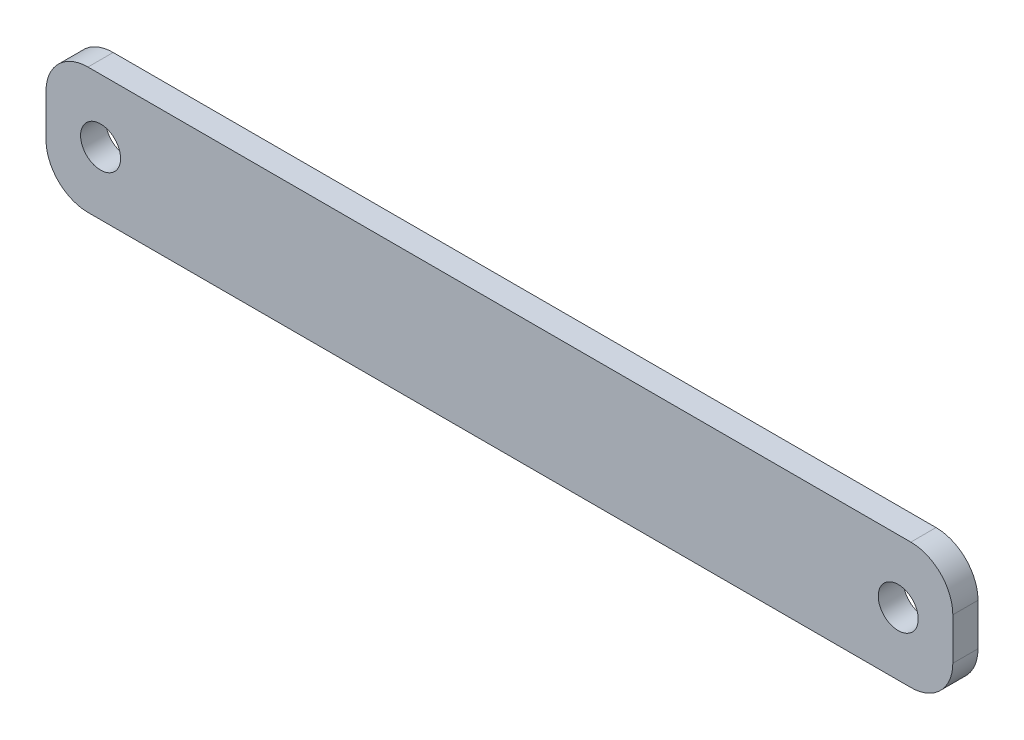
ISO-10303-21;
HEADER;
FILE_DESCRIPTION(('STEP AP214'),'2;1');
FILE_NAME('part.step','',(''),(''),'','','');
FILE_SCHEMA(('AUTOMOTIVE_DESIGN { 1 0 10303 214 1 1 1 1 }'));
ENDSEC;
DATA;
#1=APPLICATION_CONTEXT('core data for automotive mechanical design processes');
#2=APPLICATION_PROTOCOL_DEFINITION('international standard','automotive_design',2000,#1);
#3=PRODUCT_CONTEXT('',#1,'mechanical');
#4=PRODUCT('Part','Part','',(#3));
#5=PRODUCT_RELATED_PRODUCT_CATEGORY('part','',(#4));
#6=PRODUCT_DEFINITION_FORMATION('','',#4);
#7=PRODUCT_DEFINITION_CONTEXT('part definition',#1,'design');
#8=PRODUCT_DEFINITION('design','',#6,#7);
#9=PRODUCT_DEFINITION_SHAPE('','',#8);
#10=(LENGTH_UNIT() NAMED_UNIT(*) SI_UNIT(.MILLI.,.METRE.));
#11=(NAMED_UNIT(*) PLANE_ANGLE_UNIT() SI_UNIT($,.RADIAN.));
#12=(NAMED_UNIT(*) SI_UNIT($,.STERADIAN.) SOLID_ANGLE_UNIT());
#13=UNCERTAINTY_MEASURE_WITH_UNIT(LENGTH_MEASURE(1.E-05),#10,'distance_accuracy_value','');
#14=(GEOMETRIC_REPRESENTATION_CONTEXT(3) GLOBAL_UNCERTAINTY_ASSIGNED_CONTEXT((#13)) GLOBAL_UNIT_ASSIGNED_CONTEXT((#10,
#11,#12)) REPRESENTATION_CONTEXT('',''));
#15=CARTESIAN_POINT('',(0.,0.,0.));
#16=DIRECTION('',(0.,0.,1.));
#17=DIRECTION('',(1.,0.,0.));
#18=AXIS2_PLACEMENT_3D('',#15,#16,#17);
#19=CARTESIAN_POINT('',(103.,5.00000000000001,3.));
#20=DIRECTION('',(0.,0.,1.));
#21=DIRECTION('',(1.,0.,0.));
#22=AXIS2_PLACEMENT_3D('',#19,#20,#21);
#23=PLANE('',#22);
#24=CARTESIAN_POINT('',(101.5,7.5,3.));
#25=DIRECTION('',(0.,0.,1.));
#26=DIRECTION('',(1.,0.,0.));
#27=AXIS2_PLACEMENT_3D('',#24,#25,#26);
#28=CIRCLE('',#27,2.38125000000001);
#29=CARTESIAN_POINT('',(103.88125,7.5,3.));
#30=VERTEX_POINT('',#29);
#31=EDGE_CURVE('E135',#30,#30,#28,.T.);
#32=ORIENTED_EDGE('',*,*,#31,.F.);
#33=EDGE_LOOP('',(#32));
#34=FACE_BOUND('',#33,.T.);
#35=CARTESIAN_POINT('',(103.,5.00000000000001,3.));
#36=DIRECTION('',(0.,0.,1.));
#37=DIRECTION('',(1.,0.,0.));
#38=AXIS2_PLACEMENT_3D('',#35,#36,#37);
#39=CIRCLE('',#38,5.00000000000002);
#40=CARTESIAN_POINT('',(103.,0.,3.));
#41=VERTEX_POINT('',#40);
#42=CARTESIAN_POINT('',(108.,5.00000000000001,3.));
#43=VERTEX_POINT('',#42);
#44=EDGE_CURVE('E146',#41,#43,#39,.T.);
#45=ORIENTED_EDGE('',*,*,#44,.T.);
#46=DIRECTION('',(0.,1.,0.));
#47=VECTOR('',#46,1.);
#48=CARTESIAN_POINT('',(108.,5.00000000000001,3.));
#49=LINE('',#48,#47);
#50=CARTESIAN_POINT('',(108.,9.99999999999999,3.));
#51=VERTEX_POINT('',#50);
#52=EDGE_CURVE('E94',#43,#51,#49,.T.);
#53=ORIENTED_EDGE('',*,*,#52,.T.);
#54=CARTESIAN_POINT('',(103.,9.99999999999999,3.));
#55=DIRECTION('',(0.,0.,1.));
#56=DIRECTION('',(-1.,0.,0.));
#57=AXIS2_PLACEMENT_3D('',#54,#55,#56);
#58=CIRCLE('',#57,5.00000000000001);
#59=CARTESIAN_POINT('',(103.,15.,3.));
#60=VERTEX_POINT('',#59);
#61=EDGE_CURVE('E161',#51,#60,#58,.T.);
#62=ORIENTED_EDGE('',*,*,#61,.T.);
#63=DIRECTION('',(-1.,0.,0.));
#64=VECTOR('',#63,1.);
#65=CARTESIAN_POINT('',(5.00000000000004,15.,3.));
#66=LINE('',#65,#64);
#67=CARTESIAN_POINT('',(5.00000000000004,15.,3.));
#68=VERTEX_POINT('',#67);
#69=EDGE_CURVE('E174',#60,#68,#66,.T.);
#70=ORIENTED_EDGE('',*,*,#69,.T.);
#71=CARTESIAN_POINT('',(5.,10.,3.));
#72=DIRECTION('',(0.,0.,1.));
#73=DIRECTION('',(-1.,0.,0.));
#74=AXIS2_PLACEMENT_3D('',#71,#72,#73);
#75=CIRCLE('',#74,5.);
#76=CARTESIAN_POINT('',(0.,9.99999999999996,3.));
#77=VERTEX_POINT('',#76);
#78=EDGE_CURVE('E113',#68,#77,#75,.T.);
#79=ORIENTED_EDGE('',*,*,#78,.T.);
#80=DIRECTION('',(0.,-1.,0.));
#81=VECTOR('',#80,1.);
#82=CARTESIAN_POINT('',(0.,5.00000000000004,3.));
#83=LINE('',#82,#81);
#84=CARTESIAN_POINT('',(0.,5.,3.));
#85=VERTEX_POINT('',#84);
#86=EDGE_CURVE('E107',#77,#85,#83,.T.);
#87=ORIENTED_EDGE('',*,*,#86,.T.);
#88=CARTESIAN_POINT('',(5.,5.,3.));
#89=DIRECTION('',(0.,0.,1.));
#90=DIRECTION('',(-1.,0.,0.));
#91=AXIS2_PLACEMENT_3D('',#88,#89,#90);
#92=CIRCLE('',#91,5.);
#93=CARTESIAN_POINT('',(5.00000000000004,0.,3.));
#94=VERTEX_POINT('',#93);
#95=EDGE_CURVE('E111',#85,#94,#92,.T.);
#96=ORIENTED_EDGE('',*,*,#95,.T.);
#97=DIRECTION('',(1.,0.,0.));
#98=VECTOR('',#97,1.);
#99=CARTESIAN_POINT('',(5.00000000000004,0.,3.));
#100=LINE('',#99,#98);
#101=EDGE_CURVE('E51',#94,#41,#100,.T.);
#102=ORIENTED_EDGE('',*,*,#101,.T.);
#103=EDGE_LOOP('',(#45,#53,#62,#70,#79,#87,#96,#102));
#104=FACE_BOUND('',#103,.T.);
#105=CARTESIAN_POINT('',(6.49999999999999,7.49999999999999,3.));
#106=DIRECTION('',(0.,0.,1.));
#107=DIRECTION('',(-1.,0.,0.));
#108=AXIS2_PLACEMENT_3D('',#105,#106,#107);
#109=CIRCLE('',#108,2.38125000000001);
#110=CARTESIAN_POINT('',(4.11874999999999,7.49999999999999,3.));
#111=VERTEX_POINT('',#110);
#112=EDGE_CURVE('E183',#111,#111,#109,.T.);
#113=ORIENTED_EDGE('',*,*,#112,.F.);
#114=EDGE_LOOP('',(#113));
#115=FACE_BOUND('',#114,.T.);
#116=ADVANCED_FACE('F34',(#34,#104,#115),#23,.T.);
#117=CARTESIAN_POINT('',(103.,5.00000000000001,0.));
#118=DIRECTION('',(0.,0.,1.));
#119=DIRECTION('',(1.,0.,0.));
#120=AXIS2_PLACEMENT_3D('',#117,#118,#119);
#121=PLANE('',#120);
#122=CARTESIAN_POINT('',(103.,5.00000000000001,0.));
#123=DIRECTION('',(0.,0.,1.));
#124=DIRECTION('',(1.,0.,0.));
#125=AXIS2_PLACEMENT_3D('',#122,#123,#124);
#126=CIRCLE('',#125,5.00000000000002);
#127=CARTESIAN_POINT('',(103.,0.,0.));
#128=VERTEX_POINT('',#127);
#129=CARTESIAN_POINT('',(108.,5.00000000000001,0.));
#130=VERTEX_POINT('',#129);
#131=EDGE_CURVE('E131',#128,#130,#126,.T.);
#132=ORIENTED_EDGE('',*,*,#131,.F.);
#133=DIRECTION('',(1.,0.,0.));
#134=VECTOR('',#133,1.);
#135=CARTESIAN_POINT('',(5.00000000000004,0.,0.));
#136=LINE('',#135,#134);
#137=CARTESIAN_POINT('',(5.00000000000004,0.,0.));
#138=VERTEX_POINT('',#137);
#139=EDGE_CURVE('E86',#138,#128,#136,.T.);
#140=ORIENTED_EDGE('',*,*,#139,.F.);
#141=CARTESIAN_POINT('',(5.,5.,0.));
#142=DIRECTION('',(0.,0.,1.));
#143=DIRECTION('',(-1.,0.,0.));
#144=AXIS2_PLACEMENT_3D('',#141,#142,#143);
#145=CIRCLE('',#144,5.);
#146=CARTESIAN_POINT('',(0.,5.,0.));
#147=VERTEX_POINT('',#146);
#148=EDGE_CURVE('E80',#147,#138,#145,.T.);
#149=ORIENTED_EDGE('',*,*,#148,.F.);
#150=DIRECTION('',(0.,-1.,0.));
#151=VECTOR('',#150,1.);
#152=CARTESIAN_POINT('',(0.,5.00000000000004,0.));
#153=LINE('',#152,#151);
#154=CARTESIAN_POINT('',(0.,9.99999999999996,0.));
#155=VERTEX_POINT('',#154);
#156=EDGE_CURVE('E121',#155,#147,#153,.T.);
#157=ORIENTED_EDGE('',*,*,#156,.F.);
#158=CARTESIAN_POINT('',(5.,10.,0.));
#159=DIRECTION('',(0.,0.,1.));
#160=DIRECTION('',(-1.,0.,0.));
#161=AXIS2_PLACEMENT_3D('',#158,#159,#160);
#162=CIRCLE('',#161,5.);
#163=CARTESIAN_POINT('',(5.00000000000004,15.,0.));
#164=VERTEX_POINT('',#163);
#165=EDGE_CURVE('E141',#164,#155,#162,.T.);
#166=ORIENTED_EDGE('',*,*,#165,.F.);
#167=DIRECTION('',(-1.,0.,0.));
#168=VECTOR('',#167,1.);
#169=CARTESIAN_POINT('',(5.00000000000004,15.,0.));
#170=LINE('',#169,#168);
#171=CARTESIAN_POINT('',(103.,15.,0.));
#172=VERTEX_POINT('',#171);
#173=EDGE_CURVE('E139',#172,#164,#170,.T.);
#174=ORIENTED_EDGE('',*,*,#173,.F.);
#175=CARTESIAN_POINT('',(103.,9.99999999999999,0.));
#176=DIRECTION('',(0.,0.,1.));
#177=DIRECTION('',(-1.,0.,0.));
#178=AXIS2_PLACEMENT_3D('',#175,#176,#177);
#179=CIRCLE('',#178,5.00000000000001);
#180=CARTESIAN_POINT('',(108.,9.99999999999999,0.));
#181=VERTEX_POINT('',#180);
#182=EDGE_CURVE('E137',#181,#172,#179,.T.);
#183=ORIENTED_EDGE('',*,*,#182,.F.);
#184=DIRECTION('',(0.,1.,0.));
#185=VECTOR('',#184,1.);
#186=CARTESIAN_POINT('',(108.,5.00000000000001,0.));
#187=LINE('',#186,#185);
#188=EDGE_CURVE('E134',#130,#181,#187,.T.);
#189=ORIENTED_EDGE('',*,*,#188,.F.);
#190=EDGE_LOOP('',(#132,#140,#149,#157,#166,#174,#183,#189));
#191=FACE_BOUND('',#190,.T.);
#192=CARTESIAN_POINT('',(101.5,7.5,0.));
#193=DIRECTION('',(0.,0.,1.));
#194=DIRECTION('',(1.,0.,0.));
#195=AXIS2_PLACEMENT_3D('',#192,#193,#194);
#196=CIRCLE('',#195,2.38125000000001);
#197=CARTESIAN_POINT('',(103.88125,7.5,0.));
#198=VERTEX_POINT('',#197);
#199=EDGE_CURVE('E180',#198,#198,#196,.T.);
#200=ORIENTED_EDGE('',*,*,#199,.T.);
#201=EDGE_LOOP('',(#200));
#202=FACE_BOUND('',#201,.T.);
#203=CARTESIAN_POINT('',(6.49999999999999,7.49999999999999,0.));
#204=DIRECTION('',(0.,0.,1.));
#205=DIRECTION('',(-1.,0.,0.));
#206=AXIS2_PLACEMENT_3D('',#203,#204,#205);
#207=CIRCLE('',#206,2.38125000000001);
#208=CARTESIAN_POINT('',(4.11874999999999,7.49999999999999,0.));
#209=VERTEX_POINT('',#208);
#210=EDGE_CURVE('E186',#209,#209,#207,.T.);
#211=ORIENTED_EDGE('',*,*,#210,.T.);
#212=EDGE_LOOP('',(#211));
#213=FACE_BOUND('',#212,.T.);
#214=ADVANCED_FACE('F165',(#191,#202,#213),#121,.F.);
#215=CARTESIAN_POINT('',(103.,5.00000000000001,3.));
#216=DIRECTION('',(0.,0.,-1.));
#217=DIRECTION('',(-1.,0.,0.));
#218=AXIS2_PLACEMENT_3D('',#215,#216,#217);
#219=CYLINDRICAL_SURFACE('',#218,5.00000000000002);
#220=ORIENTED_EDGE('',*,*,#131,.T.);
#221=DIRECTION('',(0.,0.,-1.));
#222=VECTOR('',#221,1.);
#223=CARTESIAN_POINT('',(108.,5.00000000000001,3.));
#224=LINE('',#223,#222);
#225=EDGE_CURVE('E11',#43,#130,#224,.T.);
#226=ORIENTED_EDGE('',*,*,#225,.F.);
#227=ORIENTED_EDGE('',*,*,#44,.F.);
#228=DIRECTION('',(0.,0.,-1.));
#229=VECTOR('',#228,1.);
#230=CARTESIAN_POINT('',(103.,0.,3.));
#231=LINE('',#230,#229);
#232=EDGE_CURVE('E127',#41,#128,#231,.T.);
#233=ORIENTED_EDGE('',*,*,#232,.T.);
#234=EDGE_LOOP('',(#220,#226,#227,#233));
#235=FACE_BOUND('',#234,.T.);
#236=ADVANCED_FACE('F36',(#235),#219,.T.);
#237=CARTESIAN_POINT('',(108.,5.00000000000001,3.));
#238=DIRECTION('',(-1.,0.,0.));
#239=DIRECTION('',(0.,0.,1.));
#240=AXIS2_PLACEMENT_3D('',#237,#238,#239);
#241=PLANE('',#240);
#242=ORIENTED_EDGE('',*,*,#188,.T.);
#243=DIRECTION('',(0.,0.,-1.));
#244=VECTOR('',#243,1.);
#245=CARTESIAN_POINT('',(108.,9.99999999999999,3.));
#246=LINE('',#245,#244);
#247=EDGE_CURVE('E43',#51,#181,#246,.T.);
#248=ORIENTED_EDGE('',*,*,#247,.F.);
#249=ORIENTED_EDGE('',*,*,#52,.F.);
#250=ORIENTED_EDGE('',*,*,#225,.T.);
#251=EDGE_LOOP('',(#242,#248,#249,#250));
#252=FACE_BOUND('',#251,.T.);
#253=ADVANCED_FACE('F218',(#252),#241,.F.);
#254=CARTESIAN_POINT('',(103.,9.99999999999999,3.));
#255=DIRECTION('',(0.,0.,-1.));
#256=DIRECTION('',(-1.,0.,0.));
#257=AXIS2_PLACEMENT_3D('',#254,#255,#256);
#258=CYLINDRICAL_SURFACE('',#257,5.00000000000001);
#259=ORIENTED_EDGE('',*,*,#182,.T.);
#260=DIRECTION('',(0.,0.,-1.));
#261=VECTOR('',#260,1.);
#262=CARTESIAN_POINT('',(103.,15.,3.));
#263=LINE('',#262,#261);
#264=EDGE_CURVE('E153',#60,#172,#263,.T.);
#265=ORIENTED_EDGE('',*,*,#264,.F.);
#266=ORIENTED_EDGE('',*,*,#61,.F.);
#267=ORIENTED_EDGE('',*,*,#247,.T.);
#268=EDGE_LOOP('',(#259,#265,#266,#267));
#269=FACE_BOUND('',#268,.T.);
#270=ADVANCED_FACE('F159',(#269),#258,.T.);
#271=CARTESIAN_POINT('',(5.00000000000004,15.,3.));
#272=DIRECTION('',(0.,-1.,0.));
#273=DIRECTION('',(1.,0.,0.));
#274=AXIS2_PLACEMENT_3D('',#271,#272,#273);
#275=PLANE('',#274);
#276=ORIENTED_EDGE('',*,*,#173,.T.);
#277=DIRECTION('',(0.,0.,-1.));
#278=VECTOR('',#277,1.);
#279=CARTESIAN_POINT('',(5.00000000000004,15.,3.));
#280=LINE('',#279,#278);
#281=EDGE_CURVE('E150',#68,#164,#280,.T.);
#282=ORIENTED_EDGE('',*,*,#281,.F.);
#283=ORIENTED_EDGE('',*,*,#69,.F.);
#284=ORIENTED_EDGE('',*,*,#264,.T.);
#285=EDGE_LOOP('',(#276,#282,#283,#284));
#286=FACE_BOUND('',#285,.T.);
#287=ADVANCED_FACE('F170',(#286),#275,.F.);
#288=CARTESIAN_POINT('',(5.,10.,3.));
#289=DIRECTION('',(0.,0.,-1.));
#290=DIRECTION('',(-1.,0.,0.));
#291=AXIS2_PLACEMENT_3D('',#288,#289,#290);
#292=CYLINDRICAL_SURFACE('',#291,5.);
#293=ORIENTED_EDGE('',*,*,#165,.T.);
#294=DIRECTION('',(0.,0.,-1.));
#295=VECTOR('',#294,1.);
#296=CARTESIAN_POINT('',(0.,9.99999999999996,3.));
#297=LINE('',#296,#295);
#298=EDGE_CURVE('E122',#77,#155,#297,.T.);
#299=ORIENTED_EDGE('',*,*,#298,.F.);
#300=ORIENTED_EDGE('',*,*,#78,.F.);
#301=ORIENTED_EDGE('',*,*,#281,.T.);
#302=EDGE_LOOP('',(#293,#299,#300,#301));
#303=FACE_BOUND('',#302,.T.);
#304=ADVANCED_FACE('F173',(#303),#292,.T.);
#305=CARTESIAN_POINT('',(0.,5.00000000000004,3.));
#306=DIRECTION('',(1.,0.,0.));
#307=DIRECTION('',(0.,0.,-1.));
#308=AXIS2_PLACEMENT_3D('',#305,#306,#307);
#309=PLANE('',#308);
#310=ORIENTED_EDGE('',*,*,#156,.T.);
#311=DIRECTION('',(0.,0.,-1.));
#312=VECTOR('',#311,1.);
#313=CARTESIAN_POINT('',(0.,5.,3.));
#314=LINE('',#313,#312);
#315=EDGE_CURVE('E118',#85,#147,#314,.T.);
#316=ORIENTED_EDGE('',*,*,#315,.F.);
#317=ORIENTED_EDGE('',*,*,#86,.F.);
#318=ORIENTED_EDGE('',*,*,#298,.T.);
#319=EDGE_LOOP('',(#310,#316,#317,#318));
#320=FACE_BOUND('',#319,.T.);
#321=ADVANCED_FACE('F119',(#320),#309,.F.);
#322=CARTESIAN_POINT('',(5.,5.,3.));
#323=DIRECTION('',(0.,0.,-1.));
#324=DIRECTION('',(-1.,0.,0.));
#325=AXIS2_PLACEMENT_3D('',#322,#323,#324);
#326=CYLINDRICAL_SURFACE('',#325,5.);
#327=ORIENTED_EDGE('',*,*,#148,.T.);
#328=DIRECTION('',(0.,0.,-1.));
#329=VECTOR('',#328,1.);
#330=CARTESIAN_POINT('',(5.00000000000004,0.,3.));
#331=LINE('',#330,#329);
#332=EDGE_CURVE('E123',#94,#138,#331,.T.);
#333=ORIENTED_EDGE('',*,*,#332,.F.);
#334=ORIENTED_EDGE('',*,*,#95,.F.);
#335=ORIENTED_EDGE('',*,*,#315,.T.);
#336=EDGE_LOOP('',(#327,#333,#334,#335));
#337=FACE_BOUND('',#336,.T.);
#338=ADVANCED_FACE('F125',(#337),#326,.T.);
#339=CARTESIAN_POINT('',(5.00000000000004,0.,3.));
#340=DIRECTION('',(0.,1.,0.));
#341=DIRECTION('',(-1.,0.,0.));
#342=AXIS2_PLACEMENT_3D('',#339,#340,#341);
#343=PLANE('',#342);
#344=ORIENTED_EDGE('',*,*,#139,.T.);
#345=ORIENTED_EDGE('',*,*,#232,.F.);
#346=ORIENTED_EDGE('',*,*,#101,.F.);
#347=ORIENTED_EDGE('',*,*,#332,.T.);
#348=EDGE_LOOP('',(#344,#345,#346,#347));
#349=FACE_BOUND('',#348,.T.);
#350=ADVANCED_FACE('F206',(#349),#343,.F.);
#351=CARTESIAN_POINT('',(101.5,7.5,3.));
#352=DIRECTION('',(0.,0.,-1.));
#353=DIRECTION('',(-1.,0.,0.));
#354=AXIS2_PLACEMENT_3D('',#351,#352,#353);
#355=CYLINDRICAL_SURFACE('',#354,2.38125000000001);
#356=ORIENTED_EDGE('',*,*,#31,.T.);
#357=EDGE_LOOP('',(#356));
#358=FACE_BOUND('',#357,.T.);
#359=ORIENTED_EDGE('',*,*,#199,.F.);
#360=EDGE_LOOP('',(#359));
#361=FACE_BOUND('',#360,.T.);
#362=ADVANCED_FACE('F203',(#358,#361),#355,.F.);
#363=CARTESIAN_POINT('',(6.49999999999999,7.49999999999999,3.));
#364=DIRECTION('',(0.,0.,-1.));
#365=DIRECTION('',(-1.,0.,0.));
#366=AXIS2_PLACEMENT_3D('',#363,#364,#365);
#367=CYLINDRICAL_SURFACE('',#366,2.38125000000001);
#368=ORIENTED_EDGE('',*,*,#112,.T.);
#369=EDGE_LOOP('',(#368));
#370=FACE_BOUND('',#369,.T.);
#371=ORIENTED_EDGE('',*,*,#210,.F.);
#372=EDGE_LOOP('',(#371));
#373=FACE_BOUND('',#372,.T.);
#374=ADVANCED_FACE('F192',(#370,#373),#367,.F.);
#375=CLOSED_SHELL('',(#116,#214,#236,#253,#270,#287,#304,#321,#338,#350,#362,#374));
#376=MANIFOLD_SOLID_BREP('B2',#375);
#377=ADVANCED_BREP_SHAPE_REPRESENTATION('',(#18,#376),#14);
#378=SHAPE_DEFINITION_REPRESENTATION(#9,#377);
ENDSEC;
END-ISO-10303-21;
